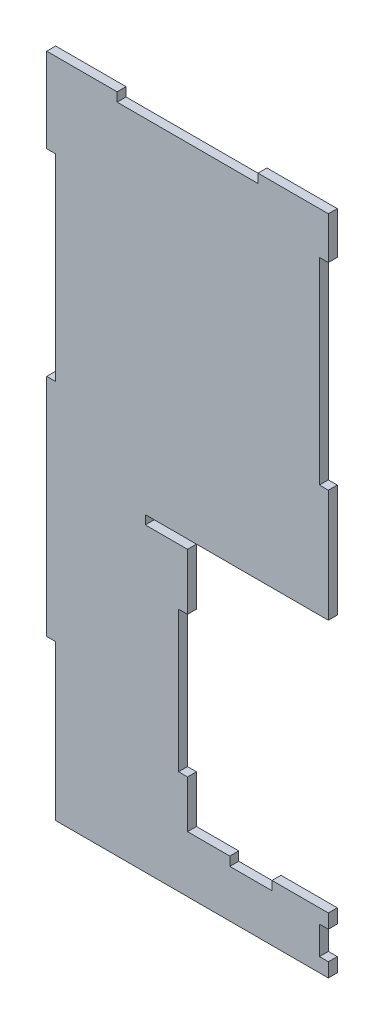
ISO-10303-21;
HEADER;
FILE_DESCRIPTION(('STEP AP214'),'2;1');
FILE_NAME('part.step','',(''),(''),'','','');
FILE_SCHEMA(('AUTOMOTIVE_DESIGN { 1 0 10303 214 1 1 1 1 }'));
ENDSEC;
DATA;
#1=APPLICATION_CONTEXT('core data for automotive mechanical design processes');
#2=APPLICATION_PROTOCOL_DEFINITION('international standard','automotive_design',2000,#1);
#3=PRODUCT_CONTEXT('',#1,'mechanical');
#4=PRODUCT('Part','Part','',(#3));
#5=PRODUCT_RELATED_PRODUCT_CATEGORY('part','',(#4));
#6=PRODUCT_DEFINITION_FORMATION('','',#4);
#7=PRODUCT_DEFINITION_CONTEXT('part definition',#1,'design');
#8=PRODUCT_DEFINITION('design','',#6,#7);
#9=PRODUCT_DEFINITION_SHAPE('','',#8);
#10=(LENGTH_UNIT() NAMED_UNIT(*) SI_UNIT(.MILLI.,.METRE.));
#11=(NAMED_UNIT(*) PLANE_ANGLE_UNIT() SI_UNIT($,.RADIAN.));
#12=(NAMED_UNIT(*) SI_UNIT($,.STERADIAN.) SOLID_ANGLE_UNIT());
#13=UNCERTAINTY_MEASURE_WITH_UNIT(LENGTH_MEASURE(1.E-05),#10,'distance_accuracy_value','');
#14=(GEOMETRIC_REPRESENTATION_CONTEXT(3) GLOBAL_UNCERTAINTY_ASSIGNED_CONTEXT((#13)) GLOBAL_UNIT_ASSIGNED_CONTEXT((#10,
#11,#12)) REPRESENTATION_CONTEXT('',''));
#15=CARTESIAN_POINT('',(0.,0.,0.));
#16=DIRECTION('',(0.,0.,1.));
#17=DIRECTION('',(1.,0.,0.));
#18=AXIS2_PLACEMENT_3D('',#15,#16,#17);
#19=CARTESIAN_POINT('',(100.,20.,-3.175));
#20=DIRECTION('',(1.,0.,0.));
#21=DIRECTION('',(0.,1.,0.));
#22=AXIS2_PLACEMENT_3D('',#19,#20,#21);
#23=PLANE('',#22);
#24=DIRECTION('',(0.,0.,1.));
#25=VECTOR('',#24,1.);
#26=CARTESIAN_POINT('',(100.,5.,-10.));
#27=LINE('',#26,#25);
#28=CARTESIAN_POINT('',(100.,5.,-3.175));
#29=VERTEX_POINT('',#28);
#30=CARTESIAN_POINT('',(100.,5.,0.));
#31=VERTEX_POINT('',#30);
#32=EDGE_CURVE('E291',#29,#31,#27,.T.);
#33=ORIENTED_EDGE('',*,*,#32,.T.);
#34=DIRECTION('',(0.,1.,0.));
#35=VECTOR('',#34,1.);
#36=CARTESIAN_POINT('',(100.,20.,0.));
#37=LINE('',#36,#35);
#38=CARTESIAN_POINT('',(100.,0.,0.));
#39=VERTEX_POINT('',#38);
#40=EDGE_CURVE('E424',#39,#31,#37,.T.);
#41=ORIENTED_EDGE('',*,*,#40,.F.);
#42=DIRECTION('',(0.,0.,1.));
#43=VECTOR('',#42,1.);
#44=CARTESIAN_POINT('',(100.,0.,-3.175));
#45=LINE('',#44,#43);
#46=CARTESIAN_POINT('',(100.,0.,-3.175));
#47=VERTEX_POINT('',#46);
#48=EDGE_CURVE('E37',#47,#39,#45,.T.);
#49=ORIENTED_EDGE('',*,*,#48,.F.);
#50=DIRECTION('',(0.,1.,0.));
#51=VECTOR('',#50,1.);
#52=CARTESIAN_POINT('',(100.,20.,-3.175));
#53=LINE('',#52,#51);
#54=EDGE_CURVE('E351',#47,#29,#53,.T.);
#55=ORIENTED_EDGE('',*,*,#54,.T.);
#56=EDGE_LOOP('',(#33,#41,#49,#55));
#57=FACE_BOUND('',#56,.T.);
#58=ADVANCED_FACE('F33',(#57),#23,.T.);
#59=CARTESIAN_POINT('',(0.,235.,-3.175));
#60=DIRECTION('',(0.,1.,0.));
#61=DIRECTION('',(0.,0.,1.));
#62=AXIS2_PLACEMENT_3D('',#59,#60,#61);
#63=PLANE('',#62);
#64=DIRECTION('',(0.,0.,1.));
#65=VECTOR('',#64,1.);
#66=CARTESIAN_POINT('',(75.,235.,-10.));
#67=LINE('',#66,#65);
#68=CARTESIAN_POINT('',(75.,235.,-3.175));
#69=VERTEX_POINT('',#68);
#70=CARTESIAN_POINT('',(75.,235.,0.));
#71=VERTEX_POINT('',#70);
#72=EDGE_CURVE('E308',#69,#71,#67,.T.);
#73=ORIENTED_EDGE('',*,*,#72,.T.);
#74=DIRECTION('',(-1.,0.,0.));
#75=VECTOR('',#74,1.);
#76=CARTESIAN_POINT('',(0.,235.,0.));
#77=LINE('',#76,#75);
#78=CARTESIAN_POINT('',(100.,235.,0.));
#79=VERTEX_POINT('',#78);
#80=EDGE_CURVE('E470',#79,#71,#77,.T.);
#81=ORIENTED_EDGE('',*,*,#80,.F.);
#82=DIRECTION('',(0.,0.,1.));
#83=VECTOR('',#82,1.);
#84=CARTESIAN_POINT('',(100.,235.,-3.175));
#85=LINE('',#84,#83);
#86=CARTESIAN_POINT('',(100.,235.,-3.175));
#87=VERTEX_POINT('',#86);
#88=EDGE_CURVE('E507',#87,#79,#85,.T.);
#89=ORIENTED_EDGE('',*,*,#88,.F.);
#90=DIRECTION('',(-1.,0.,0.));
#91=VECTOR('',#90,1.);
#92=CARTESIAN_POINT('',(0.,235.,-3.175));
#93=LINE('',#92,#91);
#94=EDGE_CURVE('E397',#87,#69,#93,.T.);
#95=ORIENTED_EDGE('',*,*,#94,.T.);
#96=EDGE_LOOP('',(#73,#81,#89,#95));
#97=FACE_BOUND('',#96,.T.);
#98=ADVANCED_FACE('F570',(#97),#63,.T.);
#99=CARTESIAN_POINT('',(50.,20.,-3.175));
#100=DIRECTION('',(0.,1.,0.));
#101=DIRECTION('',(-1.,0.,0.));
#102=AXIS2_PLACEMENT_3D('',#99,#100,#101);
#103=PLANE('',#102);
#104=DIRECTION('',(0.,0.,1.));
#105=VECTOR('',#104,1.);
#106=CARTESIAN_POINT('',(80.,20.,-10.));
#107=LINE('',#106,#105);
#108=CARTESIAN_POINT('',(80.,20.,-3.175));
#109=VERTEX_POINT('',#108);
#110=CARTESIAN_POINT('',(80.,20.,0.));
#111=VERTEX_POINT('',#110);
#112=EDGE_CURVE('E331',#109,#111,#107,.T.);
#113=ORIENTED_EDGE('',*,*,#112,.T.);
#114=DIRECTION('',(-1.,0.,0.));
#115=VECTOR('',#114,1.);
#116=CARTESIAN_POINT('',(50.,20.,0.));
#117=LINE('',#116,#115);
#118=CARTESIAN_POINT('',(100.,20.,0.));
#119=VERTEX_POINT('',#118);
#120=EDGE_CURVE('E427',#119,#111,#117,.T.);
#121=ORIENTED_EDGE('',*,*,#120,.F.);
#122=DIRECTION('',(0.,0.,1.));
#123=VECTOR('',#122,1.);
#124=CARTESIAN_POINT('',(100.,20.,-3.175));
#125=LINE('',#124,#123);
#126=CARTESIAN_POINT('',(100.,20.,-3.175));
#127=VERTEX_POINT('',#126);
#128=EDGE_CURVE('E536',#127,#119,#125,.T.);
#129=ORIENTED_EDGE('',*,*,#128,.F.);
#130=DIRECTION('',(-1.,0.,0.));
#131=VECTOR('',#130,1.);
#132=CARTESIAN_POINT('',(50.,20.,-3.175));
#133=LINE('',#132,#131);
#134=EDGE_CURVE('E355',#127,#109,#133,.T.);
#135=ORIENTED_EDGE('',*,*,#134,.T.);
#136=EDGE_LOOP('',(#113,#121,#129,#135));
#137=FACE_BOUND('',#136,.T.);
#138=ADVANCED_FACE('F577',(#137),#103,.T.);
#139=CARTESIAN_POINT('',(100.,0.,-3.175));
#140=DIRECTION('',(0.,-1.,0.));
#141=DIRECTION('',(0.,0.,-1.));
#142=AXIS2_PLACEMENT_3D('',#139,#140,#141);
#143=PLANE('',#142);
#144=DIRECTION('',(1.,0.,0.));
#145=VECTOR('',#144,1.);
#146=CARTESIAN_POINT('',(100.,0.,0.));
#147=LINE('',#146,#145);
#148=CARTESIAN_POINT('',(3.175,0.,0.));
#149=VERTEX_POINT('',#148);
#150=EDGE_CURVE('E345',#149,#39,#147,.T.);
#151=ORIENTED_EDGE('',*,*,#150,.F.);
#152=DIRECTION('',(0.,0.,1.));
#153=VECTOR('',#152,1.);
#154=CARTESIAN_POINT('',(3.175,0.,-3.175));
#155=LINE('',#154,#153);
#156=CARTESIAN_POINT('',(3.175,0.,-3.175));
#157=VERTEX_POINT('',#156);
#158=EDGE_CURVE('E11',#157,#149,#155,.T.);
#159=ORIENTED_EDGE('',*,*,#158,.F.);
#160=DIRECTION('',(1.,0.,0.));
#161=VECTOR('',#160,1.);
#162=CARTESIAN_POINT('',(100.,0.,-3.175));
#163=LINE('',#162,#161);
#164=EDGE_CURVE('E346',#157,#47,#163,.T.);
#165=ORIENTED_EDGE('',*,*,#164,.T.);
#166=ORIENTED_EDGE('',*,*,#48,.T.);
#167=EDGE_LOOP('',(#151,#159,#165,#166));
#168=FACE_BOUND('',#167,.T.);
#169=ADVANCED_FACE('F35',(#168),#143,.T.);
#170=CARTESIAN_POINT('',(3.175,0.,-3.175));
#171=DIRECTION('',(-1.,0.,0.));
#172=DIRECTION('',(0.,0.,1.));
#173=AXIS2_PLACEMENT_3D('',#170,#171,#172);
#174=PLANE('',#173);
#175=DIRECTION('',(0.,-1.,0.));
#176=VECTOR('',#175,1.);
#177=CARTESIAN_POINT('',(3.175,0.,0.));
#178=LINE('',#177,#176);
#179=CARTESIAN_POINT('',(3.175,55.,0.));
#180=VERTEX_POINT('',#179);
#181=EDGE_CURVE('E350',#180,#149,#178,.T.);
#182=ORIENTED_EDGE('',*,*,#181,.F.);
#183=DIRECTION('',(0.,0.,1.));
#184=VECTOR('',#183,1.);
#185=CARTESIAN_POINT('',(3.175,55.,-3.175));
#186=LINE('',#185,#184);
#187=CARTESIAN_POINT('',(3.175,55.,-3.175));
#188=VERTEX_POINT('',#187);
#189=EDGE_CURVE('E42',#188,#180,#186,.T.);
#190=ORIENTED_EDGE('',*,*,#189,.F.);
#191=DIRECTION('',(0.,-1.,0.));
#192=VECTOR('',#191,1.);
#193=CARTESIAN_POINT('',(3.175,0.,-3.175));
#194=LINE('',#193,#192);
#195=EDGE_CURVE('E418',#188,#157,#194,.T.);
#196=ORIENTED_EDGE('',*,*,#195,.T.);
#197=ORIENTED_EDGE('',*,*,#158,.T.);
#198=EDGE_LOOP('',(#182,#190,#196,#197));
#199=FACE_BOUND('',#198,.T.);
#200=ADVANCED_FACE('F550',(#199),#174,.T.);
#201=CARTESIAN_POINT('',(3.175,55.,-3.175));
#202=DIRECTION('',(0.,-1.,0.));
#203=DIRECTION('',(1.,0.,0.));
#204=AXIS2_PLACEMENT_3D('',#201,#202,#203);
#205=PLANE('',#204);
#206=DIRECTION('',(1.,0.,0.));
#207=VECTOR('',#206,1.);
#208=CARTESIAN_POINT('',(3.175,55.,0.));
#209=LINE('',#208,#207);
#210=CARTESIAN_POINT('',(0.,55.,0.));
#211=VERTEX_POINT('',#210);
#212=EDGE_CURVE('E488',#211,#180,#209,.T.);
#213=ORIENTED_EDGE('',*,*,#212,.F.);
#214=DIRECTION('',(0.,0.,1.));
#215=VECTOR('',#214,1.);
#216=CARTESIAN_POINT('',(0.,55.,-3.175));
#217=LINE('',#216,#215);
#218=CARTESIAN_POINT('',(0.,55.,-3.175));
#219=VERTEX_POINT('',#218);
#220=EDGE_CURVE('E494',#219,#211,#217,.T.);
#221=ORIENTED_EDGE('',*,*,#220,.F.);
#222=DIRECTION('',(1.,0.,0.));
#223=VECTOR('',#222,1.);
#224=CARTESIAN_POINT('',(3.175,55.,-3.175));
#225=LINE('',#224,#223);
#226=EDGE_CURVE('E415',#219,#188,#225,.T.);
#227=ORIENTED_EDGE('',*,*,#226,.T.);
#228=ORIENTED_EDGE('',*,*,#189,.T.);
#229=EDGE_LOOP('',(#213,#221,#227,#228));
#230=FACE_BOUND('',#229,.T.);
#231=ADVANCED_FACE('F699',(#230),#205,.T.);
#232=CARTESIAN_POINT('',(0.,55.,-3.175));
#233=DIRECTION('',(-1.,0.,0.));
#234=DIRECTION('',(0.,-1.,0.));
#235=AXIS2_PLACEMENT_3D('',#232,#233,#234);
#236=PLANE('',#235);
#237=DIRECTION('',(0.,-1.,0.));
#238=VECTOR('',#237,1.);
#239=CARTESIAN_POINT('',(0.,55.,0.));
#240=LINE('',#239,#238);
#241=CARTESIAN_POINT('',(0.,135.,0.));
#242=VERTEX_POINT('',#241);
#243=EDGE_CURVE('E485',#242,#211,#240,.T.);
#244=ORIENTED_EDGE('',*,*,#243,.F.);
#245=DIRECTION('',(0.,0.,1.));
#246=VECTOR('',#245,1.);
#247=CARTESIAN_POINT('',(0.,135.,-3.175));
#248=LINE('',#247,#246);
#249=CARTESIAN_POINT('',(0.,135.,-3.175));
#250=VERTEX_POINT('',#249);
#251=EDGE_CURVE('E496',#250,#242,#248,.T.);
#252=ORIENTED_EDGE('',*,*,#251,.F.);
#253=DIRECTION('',(0.,-1.,0.));
#254=VECTOR('',#253,1.);
#255=CARTESIAN_POINT('',(0.,55.,-3.175));
#256=LINE('',#255,#254);
#257=EDGE_CURVE('E412',#250,#219,#256,.T.);
#258=ORIENTED_EDGE('',*,*,#257,.T.);
#259=ORIENTED_EDGE('',*,*,#220,.T.);
#260=EDGE_LOOP('',(#244,#252,#258,#259));
#261=FACE_BOUND('',#260,.T.);
#262=ADVANCED_FACE('F696',(#261),#236,.T.);
#263=CARTESIAN_POINT('',(0.,135.,-3.175));
#264=DIRECTION('',(0.,1.,0.));
#265=DIRECTION('',(0.,0.,1.));
#266=AXIS2_PLACEMENT_3D('',#263,#264,#265);
#267=PLANE('',#266);
#268=DIRECTION('',(-1.,0.,0.));
#269=VECTOR('',#268,1.);
#270=CARTESIAN_POINT('',(0.,135.,0.));
#271=LINE('',#270,#269);
#272=CARTESIAN_POINT('',(3.175,135.,0.));
#273=VERTEX_POINT('',#272);
#274=EDGE_CURVE('E482',#273,#242,#271,.T.);
#275=ORIENTED_EDGE('',*,*,#274,.F.);
#276=DIRECTION('',(0.,0.,1.));
#277=VECTOR('',#276,1.);
#278=CARTESIAN_POINT('',(3.175,135.,-3.175));
#279=LINE('',#278,#277);
#280=CARTESIAN_POINT('',(3.175,135.,-3.175));
#281=VERTEX_POINT('',#280);
#282=EDGE_CURVE('E498',#281,#273,#279,.T.);
#283=ORIENTED_EDGE('',*,*,#282,.F.);
#284=DIRECTION('',(-1.,0.,0.));
#285=VECTOR('',#284,1.);
#286=CARTESIAN_POINT('',(0.,135.,-3.175));
#287=LINE('',#286,#285);
#288=EDGE_CURVE('E409',#281,#250,#287,.T.);
#289=ORIENTED_EDGE('',*,*,#288,.T.);
#290=ORIENTED_EDGE('',*,*,#251,.T.);
#291=EDGE_LOOP('',(#275,#283,#289,#290));
#292=FACE_BOUND('',#291,.T.);
#293=ADVANCED_FACE('F693',(#292),#267,.T.);
#294=CARTESIAN_POINT('',(3.175,135.,-3.175));
#295=DIRECTION('',(-1.,0.,0.));
#296=DIRECTION('',(0.,0.,1.));
#297=AXIS2_PLACEMENT_3D('',#294,#295,#296);
#298=PLANE('',#297);
#299=DIRECTION('',(0.,-1.,0.));
#300=VECTOR('',#299,1.);
#301=CARTESIAN_POINT('',(3.175,135.,0.));
#302=LINE('',#301,#300);
#303=CARTESIAN_POINT('',(3.175,205.,0.));
#304=VERTEX_POINT('',#303);
#305=EDGE_CURVE('E479',#304,#273,#302,.T.);
#306=ORIENTED_EDGE('',*,*,#305,.F.);
#307=DIRECTION('',(0.,0.,1.));
#308=VECTOR('',#307,1.);
#309=CARTESIAN_POINT('',(3.175,205.,-3.175));
#310=LINE('',#309,#308);
#311=CARTESIAN_POINT('',(3.175,205.,-3.175));
#312=VERTEX_POINT('',#311);
#313=EDGE_CURVE('E500',#312,#304,#310,.T.);
#314=ORIENTED_EDGE('',*,*,#313,.F.);
#315=DIRECTION('',(0.,-1.,0.));
#316=VECTOR('',#315,1.);
#317=CARTESIAN_POINT('',(3.175,135.,-3.175));
#318=LINE('',#317,#316);
#319=EDGE_CURVE('E406',#312,#281,#318,.T.);
#320=ORIENTED_EDGE('',*,*,#319,.T.);
#321=ORIENTED_EDGE('',*,*,#282,.T.);
#322=EDGE_LOOP('',(#306,#314,#320,#321));
#323=FACE_BOUND('',#322,.T.);
#324=ADVANCED_FACE('F689',(#323),#298,.T.);
#325=CARTESIAN_POINT('',(3.175,205.,-3.175));
#326=DIRECTION('',(0.,-1.,0.));
#327=DIRECTION('',(0.,0.,-1.));
#328=AXIS2_PLACEMENT_3D('',#325,#326,#327);
#329=PLANE('',#328);
#330=DIRECTION('',(1.,0.,0.));
#331=VECTOR('',#330,1.);
#332=CARTESIAN_POINT('',(3.175,205.,0.));
#333=LINE('',#332,#331);
#334=CARTESIAN_POINT('',(0.,205.,0.));
#335=VERTEX_POINT('',#334);
#336=EDGE_CURVE('E476',#335,#304,#333,.T.);
#337=ORIENTED_EDGE('',*,*,#336,.F.);
#338=DIRECTION('',(0.,0.,1.));
#339=VECTOR('',#338,1.);
#340=CARTESIAN_POINT('',(0.,205.,-3.175));
#341=LINE('',#340,#339);
#342=CARTESIAN_POINT('',(0.,205.,-3.175));
#343=VERTEX_POINT('',#342);
#344=EDGE_CURVE('E502',#343,#335,#341,.T.);
#345=ORIENTED_EDGE('',*,*,#344,.F.);
#346=DIRECTION('',(1.,0.,0.));
#347=VECTOR('',#346,1.);
#348=CARTESIAN_POINT('',(3.175,205.,-3.175));
#349=LINE('',#348,#347);
#350=EDGE_CURVE('E403',#343,#312,#349,.T.);
#351=ORIENTED_EDGE('',*,*,#350,.T.);
#352=ORIENTED_EDGE('',*,*,#313,.T.);
#353=EDGE_LOOP('',(#337,#345,#351,#352));
#354=FACE_BOUND('',#353,.T.);
#355=ADVANCED_FACE('F685',(#354),#329,.T.);
#356=CARTESIAN_POINT('',(0.,205.,-3.175));
#357=DIRECTION('',(-1.,0.,0.));
#358=DIRECTION('',(0.,0.,1.));
#359=AXIS2_PLACEMENT_3D('',#356,#357,#358);
#360=PLANE('',#359);
#361=DIRECTION('',(0.,-1.,0.));
#362=VECTOR('',#361,1.);
#363=CARTESIAN_POINT('',(0.,205.,0.));
#364=LINE('',#363,#362);
#365=CARTESIAN_POINT('',(0.,235.,0.));
#366=VERTEX_POINT('',#365);
#367=EDGE_CURVE('E473',#366,#335,#364,.T.);
#368=ORIENTED_EDGE('',*,*,#367,.F.);
#369=DIRECTION('',(0.,0.,1.));
#370=VECTOR('',#369,1.);
#371=CARTESIAN_POINT('',(0.,235.,-3.175));
#372=LINE('',#371,#370);
#373=CARTESIAN_POINT('',(0.,235.,-3.175));
#374=VERTEX_POINT('',#373);
#375=EDGE_CURVE('E504',#374,#366,#372,.T.);
#376=ORIENTED_EDGE('',*,*,#375,.F.);
#377=DIRECTION('',(0.,-1.,0.));
#378=VECTOR('',#377,1.);
#379=CARTESIAN_POINT('',(0.,205.,-3.175));
#380=LINE('',#379,#378);
#381=EDGE_CURVE('E400',#374,#343,#380,.T.);
#382=ORIENTED_EDGE('',*,*,#381,.T.);
#383=ORIENTED_EDGE('',*,*,#344,.T.);
#384=EDGE_LOOP('',(#368,#376,#382,#383));
#385=FACE_BOUND('',#384,.T.);
#386=ADVANCED_FACE('F681',(#385),#360,.T.);
#387=DIRECTION('',(0.,0.,1.));
#388=VECTOR('',#387,1.);
#389=CARTESIAN_POINT('',(25.,235.,-10.));
#390=LINE('',#389,#388);
#391=CARTESIAN_POINT('',(25.,235.,-3.175));
#392=VERTEX_POINT('',#391);
#393=CARTESIAN_POINT('',(25.,235.,0.));
#394=VERTEX_POINT('',#393);
#395=EDGE_CURVE('E58',#392,#394,#390,.T.);
#396=ORIENTED_EDGE('',*,*,#395,.F.);
#397=EDGE_CURVE('E396',#392,#374,#93,.T.);
#398=ORIENTED_EDGE('',*,*,#397,.T.);
#399=ORIENTED_EDGE('',*,*,#375,.T.);
#400=EDGE_CURVE('E469',#394,#366,#77,.T.);
#401=ORIENTED_EDGE('',*,*,#400,.F.);
#402=EDGE_LOOP('',(#396,#398,#399,#401));
#403=FACE_BOUND('',#402,.T.);
#404=ADVANCED_FACE('F580',(#403),#63,.T.);
#405=CARTESIAN_POINT('',(100.,235.,-3.175));
#406=DIRECTION('',(1.,0.,0.));
#407=DIRECTION('',(0.,0.,-1.));
#408=AXIS2_PLACEMENT_3D('',#405,#406,#407);
#409=PLANE('',#408);
#410=DIRECTION('',(0.,1.,0.));
#411=VECTOR('',#410,1.);
#412=CARTESIAN_POINT('',(100.,235.,0.));
#413=LINE('',#412,#411);
#414=CARTESIAN_POINT('',(100.,220.,0.));
#415=VERTEX_POINT('',#414);
#416=EDGE_CURVE('E466',#415,#79,#413,.T.);
#417=ORIENTED_EDGE('',*,*,#416,.F.);
#418=DIRECTION('',(0.,0.,1.));
#419=VECTOR('',#418,1.);
#420=CARTESIAN_POINT('',(100.,220.,-3.175));
#421=LINE('',#420,#419);
#422=CARTESIAN_POINT('',(100.,220.,-3.175));
#423=VERTEX_POINT('',#422);
#424=EDGE_CURVE('E509',#423,#415,#421,.T.);
#425=ORIENTED_EDGE('',*,*,#424,.F.);
#426=DIRECTION('',(0.,1.,0.));
#427=VECTOR('',#426,1.);
#428=CARTESIAN_POINT('',(100.,235.,-3.175));
#429=LINE('',#428,#427);
#430=EDGE_CURVE('E393',#423,#87,#429,.T.);
#431=ORIENTED_EDGE('',*,*,#430,.T.);
#432=ORIENTED_EDGE('',*,*,#88,.T.);
#433=EDGE_LOOP('',(#417,#425,#431,#432));
#434=FACE_BOUND('',#433,.T.);
#435=ADVANCED_FACE('F661',(#434),#409,.T.);
#436=CARTESIAN_POINT('',(100.,220.,-3.175));
#437=DIRECTION('',(0.,-1.,0.));
#438=DIRECTION('',(0.,0.,-1.));
#439=AXIS2_PLACEMENT_3D('',#436,#437,#438);
#440=PLANE('',#439);
#441=DIRECTION('',(1.,0.,0.));
#442=VECTOR('',#441,1.);
#443=CARTESIAN_POINT('',(100.,220.,0.));
#444=LINE('',#443,#442);
#445=CARTESIAN_POINT('',(96.825,220.,0.));
#446=VERTEX_POINT('',#445);
#447=EDGE_CURVE('E463',#446,#415,#444,.T.);
#448=ORIENTED_EDGE('',*,*,#447,.F.);
#449=DIRECTION('',(0.,0.,1.));
#450=VECTOR('',#449,1.);
#451=CARTESIAN_POINT('',(96.825,220.,-3.175));
#452=LINE('',#451,#450);
#453=CARTESIAN_POINT('',(96.825,220.,-3.175));
#454=VERTEX_POINT('',#453);
#455=EDGE_CURVE('E511',#454,#446,#452,.T.);
#456=ORIENTED_EDGE('',*,*,#455,.F.);
#457=DIRECTION('',(1.,0.,0.));
#458=VECTOR('',#457,1.);
#459=CARTESIAN_POINT('',(100.,220.,-3.175));
#460=LINE('',#459,#458);
#461=EDGE_CURVE('E390',#454,#423,#460,.T.);
#462=ORIENTED_EDGE('',*,*,#461,.T.);
#463=ORIENTED_EDGE('',*,*,#424,.T.);
#464=EDGE_LOOP('',(#448,#456,#462,#463));
#465=FACE_BOUND('',#464,.T.);
#466=ADVANCED_FACE('F657',(#465),#440,.T.);
#467=CARTESIAN_POINT('',(96.825,220.,-3.175));
#468=DIRECTION('',(1.,0.,0.));
#469=DIRECTION('',(0.,1.,0.));
#470=AXIS2_PLACEMENT_3D('',#467,#468,#469);
#471=PLANE('',#470);
#472=DIRECTION('',(0.,1.,0.));
#473=VECTOR('',#472,1.);
#474=CARTESIAN_POINT('',(96.825,220.,0.));
#475=LINE('',#474,#473);
#476=CARTESIAN_POINT('',(96.825,150.,0.));
#477=VERTEX_POINT('',#476);
#478=EDGE_CURVE('E460',#477,#446,#475,.T.);
#479=ORIENTED_EDGE('',*,*,#478,.F.);
#480=DIRECTION('',(0.,0.,1.));
#481=VECTOR('',#480,1.);
#482=CARTESIAN_POINT('',(96.825,150.,-3.175));
#483=LINE('',#482,#481);
#484=CARTESIAN_POINT('',(96.825,150.,-3.175));
#485=VERTEX_POINT('',#484);
#486=EDGE_CURVE('E513',#485,#477,#483,.T.);
#487=ORIENTED_EDGE('',*,*,#486,.F.);
#488=DIRECTION('',(0.,1.,0.));
#489=VECTOR('',#488,1.);
#490=CARTESIAN_POINT('',(96.825,220.,-3.175));
#491=LINE('',#490,#489);
#492=EDGE_CURVE('E387',#485,#454,#491,.T.);
#493=ORIENTED_EDGE('',*,*,#492,.T.);
#494=ORIENTED_EDGE('',*,*,#455,.T.);
#495=EDGE_LOOP('',(#479,#487,#493,#494));
#496=FACE_BOUND('',#495,.T.);
#497=ADVANCED_FACE('F653',(#496),#471,.T.);
#498=CARTESIAN_POINT('',(96.825,150.,-3.175));
#499=DIRECTION('',(0.,1.,0.));
#500=DIRECTION('',(0.,0.,1.));
#501=AXIS2_PLACEMENT_3D('',#498,#499,#500);
#502=PLANE('',#501);
#503=DIRECTION('',(-1.,0.,0.));
#504=VECTOR('',#503,1.);
#505=CARTESIAN_POINT('',(96.825,150.,0.));
#506=LINE('',#505,#504);
#507=CARTESIAN_POINT('',(100.,150.,0.));
#508=VERTEX_POINT('',#507);
#509=EDGE_CURVE('E457',#508,#477,#506,.T.);
#510=ORIENTED_EDGE('',*,*,#509,.F.);
#511=DIRECTION('',(0.,0.,1.));
#512=VECTOR('',#511,1.);
#513=CARTESIAN_POINT('',(100.,150.,-3.175));
#514=LINE('',#513,#512);
#515=CARTESIAN_POINT('',(100.,150.,-3.175));
#516=VERTEX_POINT('',#515);
#517=EDGE_CURVE('E515',#516,#508,#514,.T.);
#518=ORIENTED_EDGE('',*,*,#517,.F.);
#519=DIRECTION('',(-1.,0.,0.));
#520=VECTOR('',#519,1.);
#521=CARTESIAN_POINT('',(96.825,150.,-3.175));
#522=LINE('',#521,#520);
#523=EDGE_CURVE('E384',#516,#485,#522,.T.);
#524=ORIENTED_EDGE('',*,*,#523,.T.);
#525=ORIENTED_EDGE('',*,*,#486,.T.);
#526=EDGE_LOOP('',(#510,#518,#524,#525));
#527=FACE_BOUND('',#526,.T.);
#528=ADVANCED_FACE('F649',(#527),#502,.T.);
#529=CARTESIAN_POINT('',(100.,150.,-3.175));
#530=DIRECTION('',(1.,0.,0.));
#531=DIRECTION('',(0.,0.,-1.));
#532=AXIS2_PLACEMENT_3D('',#529,#530,#531);
#533=PLANE('',#532);
#534=DIRECTION('',(0.,1.,0.));
#535=VECTOR('',#534,1.);
#536=CARTESIAN_POINT('',(100.,150.,0.));
#537=LINE('',#536,#535);
#538=CARTESIAN_POINT('',(100.,110.,0.));
#539=VERTEX_POINT('',#538);
#540=EDGE_CURVE('E454',#539,#508,#537,.T.);
#541=ORIENTED_EDGE('',*,*,#540,.F.);
#542=DIRECTION('',(0.,0.,1.));
#543=VECTOR('',#542,1.);
#544=CARTESIAN_POINT('',(100.,110.,-3.175));
#545=LINE('',#544,#543);
#546=CARTESIAN_POINT('',(100.,110.,-3.175));
#547=VERTEX_POINT('',#546);
#548=EDGE_CURVE('E517',#547,#539,#545,.T.);
#549=ORIENTED_EDGE('',*,*,#548,.F.);
#550=DIRECTION('',(0.,1.,0.));
#551=VECTOR('',#550,1.);
#552=CARTESIAN_POINT('',(100.,150.,-3.175));
#553=LINE('',#552,#551);
#554=EDGE_CURVE('E381',#547,#516,#553,.T.);
#555=ORIENTED_EDGE('',*,*,#554,.T.);
#556=ORIENTED_EDGE('',*,*,#517,.T.);
#557=EDGE_LOOP('',(#541,#549,#555,#556));
#558=FACE_BOUND('',#557,.T.);
#559=ADVANCED_FACE('F645',(#558),#533,.T.);
#560=CARTESIAN_POINT('',(100.,110.,-3.175));
#561=DIRECTION('',(0.,-1.,0.));
#562=DIRECTION('',(1.,0.,0.));
#563=AXIS2_PLACEMENT_3D('',#560,#561,#562);
#564=PLANE('',#563);
#565=DIRECTION('',(1.,0.,0.));
#566=VECTOR('',#565,1.);
#567=CARTESIAN_POINT('',(100.,110.,0.));
#568=LINE('',#567,#566);
#569=CARTESIAN_POINT('',(35.,110.,0.));
#570=VERTEX_POINT('',#569);
#571=EDGE_CURVE('E451',#570,#539,#568,.T.);
#572=ORIENTED_EDGE('',*,*,#571,.F.);
#573=DIRECTION('',(0.,0.,1.));
#574=VECTOR('',#573,1.);
#575=CARTESIAN_POINT('',(35.,110.,-3.175));
#576=LINE('',#575,#574);
#577=CARTESIAN_POINT('',(35.,110.,-3.175));
#578=VERTEX_POINT('',#577);
#579=EDGE_CURVE('E519',#578,#570,#576,.T.);
#580=ORIENTED_EDGE('',*,*,#579,.F.);
#581=DIRECTION('',(1.,0.,0.));
#582=VECTOR('',#581,1.);
#583=CARTESIAN_POINT('',(50.,110.,-3.175));
#584=LINE('',#583,#582);
#585=EDGE_CURVE('E379',#578,#547,#584,.T.);
#586=ORIENTED_EDGE('',*,*,#585,.T.);
#587=ORIENTED_EDGE('',*,*,#548,.T.);
#588=EDGE_LOOP('',(#572,#580,#586,#587));
#589=FACE_BOUND('',#588,.T.);
#590=ADVANCED_FACE('F640',(#589),#564,.T.);
#591=CARTESIAN_POINT('',(35.,110.,-3.175));
#592=DIRECTION('',(1.,0.,0.));
#593=DIRECTION('',(0.,0.,-1.));
#594=AXIS2_PLACEMENT_3D('',#591,#592,#593);
#595=PLANE('',#594);
#596=DIRECTION('',(0.,1.,0.));
#597=VECTOR('',#596,1.);
#598=CARTESIAN_POINT('',(35.,110.,0.));
#599=LINE('',#598,#597);
#600=CARTESIAN_POINT('',(35.,106.825,0.));
#601=VERTEX_POINT('',#600);
#602=EDGE_CURVE('E448',#601,#570,#599,.T.);
#603=ORIENTED_EDGE('',*,*,#602,.F.);
#604=DIRECTION('',(0.,0.,1.));
#605=VECTOR('',#604,1.);
#606=CARTESIAN_POINT('',(35.,106.825,-3.175));
#607=LINE('',#606,#605);
#608=CARTESIAN_POINT('',(35.,106.825,-3.175));
#609=VERTEX_POINT('',#608);
#610=EDGE_CURVE('E522',#609,#601,#607,.T.);
#611=ORIENTED_EDGE('',*,*,#610,.F.);
#612=DIRECTION('',(0.,1.,0.));
#613=VECTOR('',#612,1.);
#614=CARTESIAN_POINT('',(35.,110.,-3.175));
#615=LINE('',#614,#613);
#616=EDGE_CURVE('E376',#609,#578,#615,.T.);
#617=ORIENTED_EDGE('',*,*,#616,.T.);
#618=ORIENTED_EDGE('',*,*,#579,.T.);
#619=EDGE_LOOP('',(#603,#611,#617,#618));
#620=FACE_BOUND('',#619,.T.);
#621=ADVANCED_FACE('F637',(#620),#595,.T.);
#622=CARTESIAN_POINT('',(35.,106.825,-3.175));
#623=DIRECTION('',(0.,1.,0.));
#624=DIRECTION('',(0.,0.,1.));
#625=AXIS2_PLACEMENT_3D('',#622,#623,#624);
#626=PLANE('',#625);
#627=DIRECTION('',(-1.,0.,0.));
#628=VECTOR('',#627,1.);
#629=CARTESIAN_POINT('',(35.,106.825,0.));
#630=LINE('',#629,#628);
#631=CARTESIAN_POINT('',(50.,106.825,0.));
#632=VERTEX_POINT('',#631);
#633=EDGE_CURVE('E445',#632,#601,#630,.T.);
#634=ORIENTED_EDGE('',*,*,#633,.F.);
#635=DIRECTION('',(0.,0.,1.));
#636=VECTOR('',#635,1.);
#637=CARTESIAN_POINT('',(50.,106.825,-3.175));
#638=LINE('',#637,#636);
#639=CARTESIAN_POINT('',(50.,106.825,-3.175));
#640=VERTEX_POINT('',#639);
#641=EDGE_CURVE('E524',#640,#632,#638,.T.);
#642=ORIENTED_EDGE('',*,*,#641,.F.);
#643=DIRECTION('',(-1.,0.,0.));
#644=VECTOR('',#643,1.);
#645=CARTESIAN_POINT('',(35.,106.825,-3.175));
#646=LINE('',#645,#644);
#647=EDGE_CURVE('E373',#640,#609,#646,.T.);
#648=ORIENTED_EDGE('',*,*,#647,.T.);
#649=ORIENTED_EDGE('',*,*,#610,.T.);
#650=EDGE_LOOP('',(#634,#642,#648,#649));
#651=FACE_BOUND('',#650,.T.);
#652=ADVANCED_FACE('F633',(#651),#626,.T.);
#653=CARTESIAN_POINT('',(50.,106.825,-3.175));
#654=DIRECTION('',(1.,0.,0.));
#655=DIRECTION('',(0.,0.,-1.));
#656=AXIS2_PLACEMENT_3D('',#653,#654,#655);
#657=PLANE('',#656);
#658=DIRECTION('',(0.,1.,0.));
#659=VECTOR('',#658,1.);
#660=CARTESIAN_POINT('',(50.,106.825,0.));
#661=LINE('',#660,#659);
#662=CARTESIAN_POINT('',(50.,86.825,0.));
#663=VERTEX_POINT('',#662);
#664=EDGE_CURVE('E442',#663,#632,#661,.T.);
#665=ORIENTED_EDGE('',*,*,#664,.F.);
#666=DIRECTION('',(0.,0.,1.));
#667=VECTOR('',#666,1.);
#668=CARTESIAN_POINT('',(50.,86.825,-3.175));
#669=LINE('',#668,#667);
#670=CARTESIAN_POINT('',(50.,86.825,-3.175));
#671=VERTEX_POINT('',#670);
#672=EDGE_CURVE('E526',#671,#663,#669,.T.);
#673=ORIENTED_EDGE('',*,*,#672,.F.);
#674=DIRECTION('',(0.,1.,0.));
#675=VECTOR('',#674,1.);
#676=CARTESIAN_POINT('',(50.,106.825,-3.175));
#677=LINE('',#676,#675);
#678=EDGE_CURVE('E370',#671,#640,#677,.T.);
#679=ORIENTED_EDGE('',*,*,#678,.T.);
#680=ORIENTED_EDGE('',*,*,#641,.T.);
#681=EDGE_LOOP('',(#665,#673,#679,#680));
#682=FACE_BOUND('',#681,.T.);
#683=ADVANCED_FACE('F629',(#682),#657,.T.);
#684=CARTESIAN_POINT('',(50.,86.825,-3.175));
#685=DIRECTION('',(0.,-1.,0.));
#686=DIRECTION('',(0.,0.,-1.));
#687=AXIS2_PLACEMENT_3D('',#684,#685,#686);
#688=PLANE('',#687);
#689=DIRECTION('',(1.,0.,0.));
#690=VECTOR('',#689,1.);
#691=CARTESIAN_POINT('',(50.,86.825,0.));
#692=LINE('',#691,#690);
#693=CARTESIAN_POINT('',(46.825,86.825,0.));
#694=VERTEX_POINT('',#693);
#695=EDGE_CURVE('E439',#694,#663,#692,.T.);
#696=ORIENTED_EDGE('',*,*,#695,.F.);
#697=DIRECTION('',(0.,0.,1.));
#698=VECTOR('',#697,1.);
#699=CARTESIAN_POINT('',(46.825,86.825,-3.175));
#700=LINE('',#699,#698);
#701=CARTESIAN_POINT('',(46.825,86.825,-3.175));
#702=VERTEX_POINT('',#701);
#703=EDGE_CURVE('E528',#702,#694,#700,.T.);
#704=ORIENTED_EDGE('',*,*,#703,.F.);
#705=DIRECTION('',(1.,0.,0.));
#706=VECTOR('',#705,1.);
#707=CARTESIAN_POINT('',(50.,86.825,-3.175));
#708=LINE('',#707,#706);
#709=EDGE_CURVE('E367',#702,#671,#708,.T.);
#710=ORIENTED_EDGE('',*,*,#709,.T.);
#711=ORIENTED_EDGE('',*,*,#672,.T.);
#712=EDGE_LOOP('',(#696,#704,#710,#711));
#713=FACE_BOUND('',#712,.T.);
#714=ADVANCED_FACE('F625',(#713),#688,.T.);
#715=CARTESIAN_POINT('',(46.825,86.825,-3.175));
#716=DIRECTION('',(1.,0.,0.));
#717=DIRECTION('',(0.,1.,0.));
#718=AXIS2_PLACEMENT_3D('',#715,#716,#717);
#719=PLANE('',#718);
#720=DIRECTION('',(0.,1.,0.));
#721=VECTOR('',#720,1.);
#722=CARTESIAN_POINT('',(46.825,86.825,0.));
#723=LINE('',#722,#721);
#724=CARTESIAN_POINT('',(46.825,36.825,0.));
#725=VERTEX_POINT('',#724);
#726=EDGE_CURVE('E436',#725,#694,#723,.T.);
#727=ORIENTED_EDGE('',*,*,#726,.F.);
#728=DIRECTION('',(0.,0.,1.));
#729=VECTOR('',#728,1.);
#730=CARTESIAN_POINT('',(46.825,36.825,-3.175));
#731=LINE('',#730,#729);
#732=CARTESIAN_POINT('',(46.825,36.825,-3.175));
#733=VERTEX_POINT('',#732);
#734=EDGE_CURVE('E530',#733,#725,#731,.T.);
#735=ORIENTED_EDGE('',*,*,#734,.F.);
#736=DIRECTION('',(0.,1.,0.));
#737=VECTOR('',#736,1.);
#738=CARTESIAN_POINT('',(46.825,86.825,-3.175));
#739=LINE('',#738,#737);
#740=EDGE_CURVE('E364',#733,#702,#739,.T.);
#741=ORIENTED_EDGE('',*,*,#740,.T.);
#742=ORIENTED_EDGE('',*,*,#703,.T.);
#743=EDGE_LOOP('',(#727,#735,#741,#742));
#744=FACE_BOUND('',#743,.T.);
#745=ADVANCED_FACE('F621',(#744),#719,.T.);
#746=CARTESIAN_POINT('',(46.825,36.825,-3.175));
#747=DIRECTION('',(0.,1.,0.));
#748=DIRECTION('',(0.,0.,1.));
#749=AXIS2_PLACEMENT_3D('',#746,#747,#748);
#750=PLANE('',#749);
#751=DIRECTION('',(-1.,0.,0.));
#752=VECTOR('',#751,1.);
#753=CARTESIAN_POINT('',(46.825,36.825,0.));
#754=LINE('',#753,#752);
#755=CARTESIAN_POINT('',(50.,36.825,0.));
#756=VERTEX_POINT('',#755);
#757=EDGE_CURVE('E433',#756,#725,#754,.T.);
#758=ORIENTED_EDGE('',*,*,#757,.F.);
#759=DIRECTION('',(0.,0.,1.));
#760=VECTOR('',#759,1.);
#761=CARTESIAN_POINT('',(50.,36.825,-3.175));
#762=LINE('',#761,#760);
#763=CARTESIAN_POINT('',(50.,36.825,-3.175));
#764=VERTEX_POINT('',#763);
#765=EDGE_CURVE('E532',#764,#756,#762,.T.);
#766=ORIENTED_EDGE('',*,*,#765,.F.);
#767=DIRECTION('',(-1.,0.,0.));
#768=VECTOR('',#767,1.);
#769=CARTESIAN_POINT('',(46.825,36.825,-3.175));
#770=LINE('',#769,#768);
#771=EDGE_CURVE('E361',#764,#733,#770,.T.);
#772=ORIENTED_EDGE('',*,*,#771,.T.);
#773=ORIENTED_EDGE('',*,*,#734,.T.);
#774=EDGE_LOOP('',(#758,#766,#772,#773));
#775=FACE_BOUND('',#774,.T.);
#776=ADVANCED_FACE('F617',(#775),#750,.T.);
#777=CARTESIAN_POINT('',(50.,36.825,-3.175));
#778=DIRECTION('',(1.,0.,0.));
#779=DIRECTION('',(0.,0.,-1.));
#780=AXIS2_PLACEMENT_3D('',#777,#778,#779);
#781=PLANE('',#780);
#782=DIRECTION('',(0.,1.,0.));
#783=VECTOR('',#782,1.);
#784=CARTESIAN_POINT('',(50.,36.825,0.));
#785=LINE('',#784,#783);
#786=CARTESIAN_POINT('',(50.,20.,0.));
#787=VERTEX_POINT('',#786);
#788=EDGE_CURVE('E430',#787,#756,#785,.T.);
#789=ORIENTED_EDGE('',*,*,#788,.F.);
#790=DIRECTION('',(0.,0.,1.));
#791=VECTOR('',#790,1.);
#792=CARTESIAN_POINT('',(50.,20.,-3.175));
#793=LINE('',#792,#791);
#794=CARTESIAN_POINT('',(50.,20.,-3.175));
#795=VERTEX_POINT('',#794);
#796=EDGE_CURVE('E534',#795,#787,#793,.T.);
#797=ORIENTED_EDGE('',*,*,#796,.F.);
#798=DIRECTION('',(0.,1.,0.));
#799=VECTOR('',#798,1.);
#800=CARTESIAN_POINT('',(50.,36.825,-3.175));
#801=LINE('',#800,#799);
#802=EDGE_CURVE('E358',#795,#764,#801,.T.);
#803=ORIENTED_EDGE('',*,*,#802,.T.);
#804=ORIENTED_EDGE('',*,*,#765,.T.);
#805=EDGE_LOOP('',(#789,#797,#803,#804));
#806=FACE_BOUND('',#805,.T.);
#807=ADVANCED_FACE('F588',(#806),#781,.T.);
#808=DIRECTION('',(0.,0.,1.));
#809=VECTOR('',#808,1.);
#810=CARTESIAN_POINT('',(65.,20.,-10.));
#811=LINE('',#810,#809);
#812=CARTESIAN_POINT('',(65.,20.,-3.175));
#813=VERTEX_POINT('',#812);
#814=CARTESIAN_POINT('',(65.,20.,0.));
#815=VERTEX_POINT('',#814);
#816=EDGE_CURVE('E330',#813,#815,#811,.T.);
#817=ORIENTED_EDGE('',*,*,#816,.F.);
#818=EDGE_CURVE('E354',#813,#795,#133,.T.);
#819=ORIENTED_EDGE('',*,*,#818,.T.);
#820=ORIENTED_EDGE('',*,*,#796,.T.);
#821=EDGE_CURVE('E426',#815,#787,#117,.T.);
#822=ORIENTED_EDGE('',*,*,#821,.F.);
#823=EDGE_LOOP('',(#817,#819,#820,#822));
#824=FACE_BOUND('',#823,.T.);
#825=ADVANCED_FACE('F582',(#824),#103,.T.);
#826=DIRECTION('',(0.,0.,1.));
#827=VECTOR('',#826,1.);
#828=CARTESIAN_POINT('',(100.,15.,-10.));
#829=LINE('',#828,#827);
#830=CARTESIAN_POINT('',(100.,15.,-3.175));
#831=VERTEX_POINT('',#830);
#832=CARTESIAN_POINT('',(100.,15.,0.));
#833=VERTEX_POINT('',#832);
#834=EDGE_CURVE('E50',#831,#833,#829,.T.);
#835=ORIENTED_EDGE('',*,*,#834,.F.);
#836=EDGE_CURVE('E349',#831,#127,#53,.T.);
#837=ORIENTED_EDGE('',*,*,#836,.T.);
#838=ORIENTED_EDGE('',*,*,#128,.T.);
#839=EDGE_CURVE('E423',#833,#119,#37,.T.);
#840=ORIENTED_EDGE('',*,*,#839,.F.);
#841=EDGE_LOOP('',(#835,#837,#838,#840));
#842=FACE_BOUND('',#841,.T.);
#843=ADVANCED_FACE('F571',(#842),#23,.T.);
#844=CARTESIAN_POINT('',(0.,0.,-3.175));
#845=DIRECTION('',(0.,0.,-1.));
#846=DIRECTION('',(-1.,0.,0.));
#847=AXIS2_PLACEMENT_3D('',#844,#845,#846);
#848=PLANE('',#847);
#849=DIRECTION('',(-1.,0.,0.));
#850=VECTOR('',#849,1.);
#851=CARTESIAN_POINT('',(0.,5.00000000000003,-3.175));
#852=LINE('',#851,#850);
#853=CARTESIAN_POINT('',(96.825,5.,-3.175));
#854=VERTEX_POINT('',#853);
#855=EDGE_CURVE('E299',#29,#854,#852,.T.);
#856=ORIENTED_EDGE('',*,*,#855,.F.);
#857=ORIENTED_EDGE('',*,*,#54,.F.);
#858=ORIENTED_EDGE('',*,*,#164,.F.);
#859=ORIENTED_EDGE('',*,*,#195,.F.);
#860=ORIENTED_EDGE('',*,*,#226,.F.);
#861=ORIENTED_EDGE('',*,*,#257,.F.);
#862=ORIENTED_EDGE('',*,*,#288,.F.);
#863=ORIENTED_EDGE('',*,*,#319,.F.);
#864=ORIENTED_EDGE('',*,*,#350,.F.);
#865=ORIENTED_EDGE('',*,*,#381,.F.);
#866=ORIENTED_EDGE('',*,*,#397,.F.);
#867=DIRECTION('',(0.,1.,0.));
#868=VECTOR('',#867,1.);
#869=CARTESIAN_POINT('',(25.0000000000003,0.,-3.175));
#870=LINE('',#869,#868);
#871=CARTESIAN_POINT('',(25.,231.825,-3.175));
#872=VERTEX_POINT('',#871);
#873=EDGE_CURVE('E311',#872,#392,#870,.T.);
#874=ORIENTED_EDGE('',*,*,#873,.F.);
#875=DIRECTION('',(-1.,0.,0.));
#876=VECTOR('',#875,1.);
#877=CARTESIAN_POINT('',(0.,231.825,-3.175));
#878=LINE('',#877,#876);
#879=CARTESIAN_POINT('',(75.,231.825,-3.175));
#880=VERTEX_POINT('',#879);
#881=EDGE_CURVE('E318',#880,#872,#878,.T.);
#882=ORIENTED_EDGE('',*,*,#881,.F.);
#883=DIRECTION('',(0.,-1.,0.));
#884=VECTOR('',#883,1.);
#885=CARTESIAN_POINT('',(75.,0.,-3.175));
#886=LINE('',#885,#884);
#887=EDGE_CURVE('E320',#69,#880,#886,.T.);
#888=ORIENTED_EDGE('',*,*,#887,.F.);
#889=ORIENTED_EDGE('',*,*,#94,.F.);
#890=ORIENTED_EDGE('',*,*,#430,.F.);
#891=ORIENTED_EDGE('',*,*,#461,.F.);
#892=ORIENTED_EDGE('',*,*,#492,.F.);
#893=ORIENTED_EDGE('',*,*,#523,.F.);
#894=ORIENTED_EDGE('',*,*,#554,.F.);
#895=ORIENTED_EDGE('',*,*,#585,.F.);
#896=ORIENTED_EDGE('',*,*,#616,.F.);
#897=ORIENTED_EDGE('',*,*,#647,.F.);
#898=ORIENTED_EDGE('',*,*,#678,.F.);
#899=ORIENTED_EDGE('',*,*,#709,.F.);
#900=ORIENTED_EDGE('',*,*,#740,.F.);
#901=ORIENTED_EDGE('',*,*,#771,.F.);
#902=ORIENTED_EDGE('',*,*,#802,.F.);
#903=ORIENTED_EDGE('',*,*,#818,.F.);
#904=DIRECTION('',(0.,1.,0.));
#905=VECTOR('',#904,1.);
#906=CARTESIAN_POINT('',(65.,0.,-3.175));
#907=LINE('',#906,#905);
#908=CARTESIAN_POINT('',(65.,16.825,-3.175));
#909=VERTEX_POINT('',#908);
#910=EDGE_CURVE('E334',#909,#813,#907,.T.);
#911=ORIENTED_EDGE('',*,*,#910,.F.);
#912=DIRECTION('',(-1.,0.,0.));
#913=VECTOR('',#912,1.);
#914=CARTESIAN_POINT('',(0.,16.825,-3.175));
#915=LINE('',#914,#913);
#916=CARTESIAN_POINT('',(80.,16.825,-3.175));
#917=VERTEX_POINT('',#916);
#918=EDGE_CURVE('E341',#917,#909,#915,.T.);
#919=ORIENTED_EDGE('',*,*,#918,.F.);
#920=DIRECTION('',(0.,-1.,0.));
#921=VECTOR('',#920,1.);
#922=CARTESIAN_POINT('',(80.,0.,-3.175));
#923=LINE('',#922,#921);
#924=EDGE_CURVE('E343',#109,#917,#923,.T.);
#925=ORIENTED_EDGE('',*,*,#924,.F.);
#926=ORIENTED_EDGE('',*,*,#134,.F.);
#927=ORIENTED_EDGE('',*,*,#836,.F.);
#928=DIRECTION('',(1.,0.,0.));
#929=VECTOR('',#928,1.);
#930=CARTESIAN_POINT('',(0.,14.9999999999999,-3.175));
#931=LINE('',#930,#929);
#932=CARTESIAN_POINT('',(96.825,15.,-3.175));
#933=VERTEX_POINT('',#932);
#934=EDGE_CURVE('E294',#933,#831,#931,.T.);
#935=ORIENTED_EDGE('',*,*,#934,.F.);
#936=DIRECTION('',(0.,1.,0.));
#937=VECTOR('',#936,1.);
#938=CARTESIAN_POINT('',(96.825,1.34371680449164E-13,-3.175));
#939=LINE('',#938,#937);
#940=EDGE_CURVE('E276',#854,#933,#939,.T.);
#941=ORIENTED_EDGE('',*,*,#940,.F.);
#942=EDGE_LOOP('',(#856,#857,#858,#859,#860,#861,#862,#863,#864,#865,#866,#874,#882,#888,#889,
#890,#891,#892,#893,#894,#895,#896,#897,#898,#899,#900,#901,#902,#903,#911,#919,#925,#926,#927,
#935,#941));
#943=FACE_BOUND('',#942,.T.);
#944=ADVANCED_FACE('F554',(#943),#848,.T.);
#945=CARTESIAN_POINT('',(0.,0.,0.));
#946=DIRECTION('',(0.,0.,-1.));
#947=DIRECTION('',(-1.,0.,0.));
#948=AXIS2_PLACEMENT_3D('',#945,#946,#947);
#949=PLANE('',#948);
#950=ORIENTED_EDGE('',*,*,#40,.T.);
#951=DIRECTION('',(1.,0.,0.));
#952=VECTOR('',#951,1.);
#953=CARTESIAN_POINT('',(96.825,5.,0.));
#954=LINE('',#953,#952);
#955=CARTESIAN_POINT('',(96.825,5.,0.));
#956=VERTEX_POINT('',#955);
#957=EDGE_CURVE('E287',#956,#31,#954,.T.);
#958=ORIENTED_EDGE('',*,*,#957,.F.);
#959=DIRECTION('',(0.,-1.,0.));
#960=VECTOR('',#959,1.);
#961=CARTESIAN_POINT('',(96.825,15.,0.));
#962=LINE('',#961,#960);
#963=CARTESIAN_POINT('',(96.825,15.,0.));
#964=VERTEX_POINT('',#963);
#965=EDGE_CURVE('E273',#964,#956,#962,.T.);
#966=ORIENTED_EDGE('',*,*,#965,.F.);
#967=DIRECTION('',(-1.,0.,0.));
#968=VECTOR('',#967,1.);
#969=CARTESIAN_POINT('',(100.,15.,0.));
#970=LINE('',#969,#968);
#971=EDGE_CURVE('E280',#833,#964,#970,.T.);
#972=ORIENTED_EDGE('',*,*,#971,.F.);
#973=ORIENTED_EDGE('',*,*,#839,.T.);
#974=ORIENTED_EDGE('',*,*,#120,.T.);
#975=DIRECTION('',(0.,1.,0.));
#976=VECTOR('',#975,1.);
#977=CARTESIAN_POINT('',(80.,16.825,0.));
#978=LINE('',#977,#976);
#979=CARTESIAN_POINT('',(80.,16.825,0.));
#980=VERTEX_POINT('',#979);
#981=EDGE_CURVE('E328',#980,#111,#978,.T.);
#982=ORIENTED_EDGE('',*,*,#981,.F.);
#983=DIRECTION('',(1.,0.,0.));
#984=VECTOR('',#983,1.);
#985=CARTESIAN_POINT('',(65.,16.825,0.));
#986=LINE('',#985,#984);
#987=CARTESIAN_POINT('',(65.,16.825,0.));
#988=VERTEX_POINT('',#987);
#989=EDGE_CURVE('E325',#988,#980,#986,.T.);
#990=ORIENTED_EDGE('',*,*,#989,.F.);
#991=DIRECTION('',(0.,-1.,0.));
#992=VECTOR('',#991,1.);
#993=CARTESIAN_POINT('',(65.,20.,0.));
#994=LINE('',#993,#992);
#995=EDGE_CURVE('E322',#815,#988,#994,.T.);
#996=ORIENTED_EDGE('',*,*,#995,.F.);
#997=ORIENTED_EDGE('',*,*,#821,.T.);
#998=ORIENTED_EDGE('',*,*,#788,.T.);
#999=ORIENTED_EDGE('',*,*,#757,.T.);
#1000=ORIENTED_EDGE('',*,*,#726,.T.);
#1001=ORIENTED_EDGE('',*,*,#695,.T.);
#1002=ORIENTED_EDGE('',*,*,#664,.T.);
#1003=ORIENTED_EDGE('',*,*,#633,.T.);
#1004=ORIENTED_EDGE('',*,*,#602,.T.);
#1005=ORIENTED_EDGE('',*,*,#571,.T.);
#1006=ORIENTED_EDGE('',*,*,#540,.T.);
#1007=ORIENTED_EDGE('',*,*,#509,.T.);
#1008=ORIENTED_EDGE('',*,*,#478,.T.);
#1009=ORIENTED_EDGE('',*,*,#447,.T.);
#1010=ORIENTED_EDGE('',*,*,#416,.T.);
#1011=ORIENTED_EDGE('',*,*,#80,.T.);
#1012=DIRECTION('',(0.,1.,0.));
#1013=VECTOR('',#1012,1.);
#1014=CARTESIAN_POINT('',(75.,231.825,0.));
#1015=LINE('',#1014,#1013);
#1016=CARTESIAN_POINT('',(75.,231.825,0.));
#1017=VERTEX_POINT('',#1016);
#1018=EDGE_CURVE('E306',#1017,#71,#1015,.T.);
#1019=ORIENTED_EDGE('',*,*,#1018,.F.);
#1020=DIRECTION('',(1.,0.,0.));
#1021=VECTOR('',#1020,1.);
#1022=CARTESIAN_POINT('',(25.,231.825,0.));
#1023=LINE('',#1022,#1021);
#1024=CARTESIAN_POINT('',(25.,231.825,0.));
#1025=VERTEX_POINT('',#1024);
#1026=EDGE_CURVE('E303',#1025,#1017,#1023,.T.);
#1027=ORIENTED_EDGE('',*,*,#1026,.F.);
#1028=DIRECTION('',(0.,-1.,0.));
#1029=VECTOR('',#1028,1.);
#1030=CARTESIAN_POINT('',(25.,235.,0.));
#1031=LINE('',#1030,#1029);
#1032=EDGE_CURVE('E301',#394,#1025,#1031,.T.);
#1033=ORIENTED_EDGE('',*,*,#1032,.F.);
#1034=ORIENTED_EDGE('',*,*,#400,.T.);
#1035=ORIENTED_EDGE('',*,*,#367,.T.);
#1036=ORIENTED_EDGE('',*,*,#336,.T.);
#1037=ORIENTED_EDGE('',*,*,#305,.T.);
#1038=ORIENTED_EDGE('',*,*,#274,.T.);
#1039=ORIENTED_EDGE('',*,*,#243,.T.);
#1040=ORIENTED_EDGE('',*,*,#212,.T.);
#1041=ORIENTED_EDGE('',*,*,#181,.T.);
#1042=ORIENTED_EDGE('',*,*,#150,.T.);
#1043=EDGE_LOOP('',(#950,#958,#966,#972,#973,#974,#982,#990,#996,#997,#998,#999,#1000,#1001,
#1002,#1003,#1004,#1005,#1006,#1007,#1008,#1009,#1010,#1011,#1019,#1027,#1033,#1034,#1035,#1036,
#1037,#1038,#1039,#1040,#1041,#1042));
#1044=FACE_BOUND('',#1043,.T.);
#1045=ADVANCED_FACE('F286',(#1044),#949,.F.);
#1046=CARTESIAN_POINT('',(80.,16.825,-10.));
#1047=DIRECTION('',(1.,0.,0.));
#1048=DIRECTION('',(0.,0.,-1.));
#1049=AXIS2_PLACEMENT_3D('',#1046,#1047,#1048);
#1050=PLANE('',#1049);
#1051=ORIENTED_EDGE('',*,*,#924,.T.);
#1052=DIRECTION('',(0.,0.,1.));
#1053=VECTOR('',#1052,1.);
#1054=CARTESIAN_POINT('',(80.,16.825,-10.));
#1055=LINE('',#1054,#1053);
#1056=EDGE_CURVE('E335',#917,#980,#1055,.T.);
#1057=ORIENTED_EDGE('',*,*,#1056,.T.);
#1058=ORIENTED_EDGE('',*,*,#981,.T.);
#1059=ORIENTED_EDGE('',*,*,#112,.F.);
#1060=EDGE_LOOP('',(#1051,#1057,#1058,#1059));
#1061=FACE_BOUND('',#1060,.T.);
#1062=ADVANCED_FACE('F599',(#1061),#1050,.F.);
#1063=CARTESIAN_POINT('',(65.,16.825,-10.));
#1064=DIRECTION('',(0.,-1.,0.));
#1065=DIRECTION('',(0.,0.,-1.));
#1066=AXIS2_PLACEMENT_3D('',#1063,#1064,#1065);
#1067=PLANE('',#1066);
#1068=ORIENTED_EDGE('',*,*,#918,.T.);
#1069=DIRECTION('',(0.,0.,1.));
#1070=VECTOR('',#1069,1.);
#1071=CARTESIAN_POINT('',(65.,16.825,-10.));
#1072=LINE('',#1071,#1070);
#1073=EDGE_CURVE('E337',#909,#988,#1072,.T.);
#1074=ORIENTED_EDGE('',*,*,#1073,.T.);
#1075=ORIENTED_EDGE('',*,*,#989,.T.);
#1076=ORIENTED_EDGE('',*,*,#1056,.F.);
#1077=EDGE_LOOP('',(#1068,#1074,#1075,#1076));
#1078=FACE_BOUND('',#1077,.T.);
#1079=ADVANCED_FACE('F602',(#1078),#1067,.F.);
#1080=CARTESIAN_POINT('',(65.,20.,-10.));
#1081=DIRECTION('',(-1.,0.,0.));
#1082=DIRECTION('',(0.,0.,1.));
#1083=AXIS2_PLACEMENT_3D('',#1080,#1081,#1082);
#1084=PLANE('',#1083);
#1085=ORIENTED_EDGE('',*,*,#910,.T.);
#1086=ORIENTED_EDGE('',*,*,#816,.T.);
#1087=ORIENTED_EDGE('',*,*,#995,.T.);
#1088=ORIENTED_EDGE('',*,*,#1073,.F.);
#1089=EDGE_LOOP('',(#1085,#1086,#1087,#1088));
#1090=FACE_BOUND('',#1089,.T.);
#1091=ADVANCED_FACE('F606',(#1090),#1084,.F.);
#1092=CARTESIAN_POINT('',(75.,231.825,-10.));
#1093=DIRECTION('',(1.,0.,0.));
#1094=DIRECTION('',(0.,0.,-1.));
#1095=AXIS2_PLACEMENT_3D('',#1092,#1093,#1094);
#1096=PLANE('',#1095);
#1097=ORIENTED_EDGE('',*,*,#887,.T.);
#1098=DIRECTION('',(0.,0.,1.));
#1099=VECTOR('',#1098,1.);
#1100=CARTESIAN_POINT('',(75.,231.825,-10.));
#1101=LINE('',#1100,#1099);
#1102=EDGE_CURVE('E312',#880,#1017,#1101,.T.);
#1103=ORIENTED_EDGE('',*,*,#1102,.T.);
#1104=ORIENTED_EDGE('',*,*,#1018,.T.);
#1105=ORIENTED_EDGE('',*,*,#72,.F.);
#1106=EDGE_LOOP('',(#1097,#1103,#1104,#1105));
#1107=FACE_BOUND('',#1106,.T.);
#1108=ADVANCED_FACE('F668',(#1107),#1096,.F.);
#1109=CARTESIAN_POINT('',(25.,231.825,-10.));
#1110=DIRECTION('',(0.,-1.,0.));
#1111=DIRECTION('',(0.,0.,-1.));
#1112=AXIS2_PLACEMENT_3D('',#1109,#1110,#1111);
#1113=PLANE('',#1112);
#1114=ORIENTED_EDGE('',*,*,#881,.T.);
#1115=DIRECTION('',(0.,0.,1.));
#1116=VECTOR('',#1115,1.);
#1117=CARTESIAN_POINT('',(25.,231.825,-10.));
#1118=LINE('',#1117,#1116);
#1119=EDGE_CURVE('E314',#872,#1025,#1118,.T.);
#1120=ORIENTED_EDGE('',*,*,#1119,.T.);
#1121=ORIENTED_EDGE('',*,*,#1026,.T.);
#1122=ORIENTED_EDGE('',*,*,#1102,.F.);
#1123=EDGE_LOOP('',(#1114,#1120,#1121,#1122));
#1124=FACE_BOUND('',#1123,.T.);
#1125=ADVANCED_FACE('F567',(#1124),#1113,.F.);
#1126=CARTESIAN_POINT('',(25.,235.,-10.));
#1127=DIRECTION('',(-1.,0.,0.));
#1128=DIRECTION('',(0.,-1.,0.));
#1129=AXIS2_PLACEMENT_3D('',#1126,#1127,#1128);
#1130=PLANE('',#1129);
#1131=ORIENTED_EDGE('',*,*,#873,.T.);
#1132=ORIENTED_EDGE('',*,*,#395,.T.);
#1133=ORIENTED_EDGE('',*,*,#1032,.T.);
#1134=ORIENTED_EDGE('',*,*,#1119,.F.);
#1135=EDGE_LOOP('',(#1131,#1132,#1133,#1134));
#1136=FACE_BOUND('',#1135,.T.);
#1137=ADVANCED_FACE('F559',(#1136),#1130,.F.);
#1138=CARTESIAN_POINT('',(96.825,5.,-10.));
#1139=DIRECTION('',(0.,-1.,0.));
#1140=DIRECTION('',(1.,0.,0.));
#1141=AXIS2_PLACEMENT_3D('',#1138,#1139,#1140);
#1142=PLANE('',#1141);
#1143=ORIENTED_EDGE('',*,*,#855,.T.);
#1144=DIRECTION('',(0.,0.,1.));
#1145=VECTOR('',#1144,1.);
#1146=CARTESIAN_POINT('',(96.825,5.,-10.));
#1147=LINE('',#1146,#1145);
#1148=EDGE_CURVE('E278',#854,#956,#1147,.T.);
#1149=ORIENTED_EDGE('',*,*,#1148,.T.);
#1150=ORIENTED_EDGE('',*,*,#957,.T.);
#1151=ORIENTED_EDGE('',*,*,#32,.F.);
#1152=EDGE_LOOP('',(#1143,#1149,#1150,#1151));
#1153=FACE_BOUND('',#1152,.T.);
#1154=ADVANCED_FACE('F557',(#1153),#1142,.F.);
#1155=CARTESIAN_POINT('',(96.825,15.,-10.));
#1156=DIRECTION('',(-1.,0.,0.));
#1157=DIRECTION('',(0.,-1.,0.));
#1158=AXIS2_PLACEMENT_3D('',#1155,#1156,#1157);
#1159=PLANE('',#1158);
#1160=ORIENTED_EDGE('',*,*,#940,.T.);
#1161=DIRECTION('',(0.,0.,1.));
#1162=VECTOR('',#1161,1.);
#1163=CARTESIAN_POINT('',(96.825,15.,-10.));
#1164=LINE('',#1163,#1162);
#1165=EDGE_CURVE('E269',#933,#964,#1164,.T.);
#1166=ORIENTED_EDGE('',*,*,#1165,.T.);
#1167=ORIENTED_EDGE('',*,*,#965,.T.);
#1168=ORIENTED_EDGE('',*,*,#1148,.F.);
#1169=EDGE_LOOP('',(#1160,#1166,#1167,#1168));
#1170=FACE_BOUND('',#1169,.T.);
#1171=ADVANCED_FACE('F270',(#1170),#1159,.F.);
#1172=CARTESIAN_POINT('',(100.,15.,-10.));
#1173=DIRECTION('',(0.,1.,0.));
#1174=DIRECTION('',(-1.,0.,0.));
#1175=AXIS2_PLACEMENT_3D('',#1172,#1173,#1174);
#1176=PLANE('',#1175);
#1177=ORIENTED_EDGE('',*,*,#934,.T.);
#1178=ORIENTED_EDGE('',*,*,#834,.T.);
#1179=ORIENTED_EDGE('',*,*,#971,.T.);
#1180=ORIENTED_EDGE('',*,*,#1165,.F.);
#1181=EDGE_LOOP('',(#1177,#1178,#1179,#1180));
#1182=FACE_BOUND('',#1181,.T.);
#1183=ADVANCED_FACE('F281',(#1182),#1176,.F.);
#1184=CLOSED_SHELL('',(#58,#98,#138,#169,#200,#231,#262,#293,#324,#355,#386,#404,#435,#466,#497,
#528,#559,#590,#621,#652,#683,#714,#745,#776,#807,#825,#843,#944,#1045,#1062,#1079,#1091,#1108,
#1125,#1137,#1154,#1171,#1183));
#1185=MANIFOLD_SOLID_BREP('B2',#1184);
#1186=ADVANCED_BREP_SHAPE_REPRESENTATION('',(#18,#1185),#14);
#1187=SHAPE_DEFINITION_REPRESENTATION(#9,#1186);
ENDSEC;
END-ISO-10303-21;
